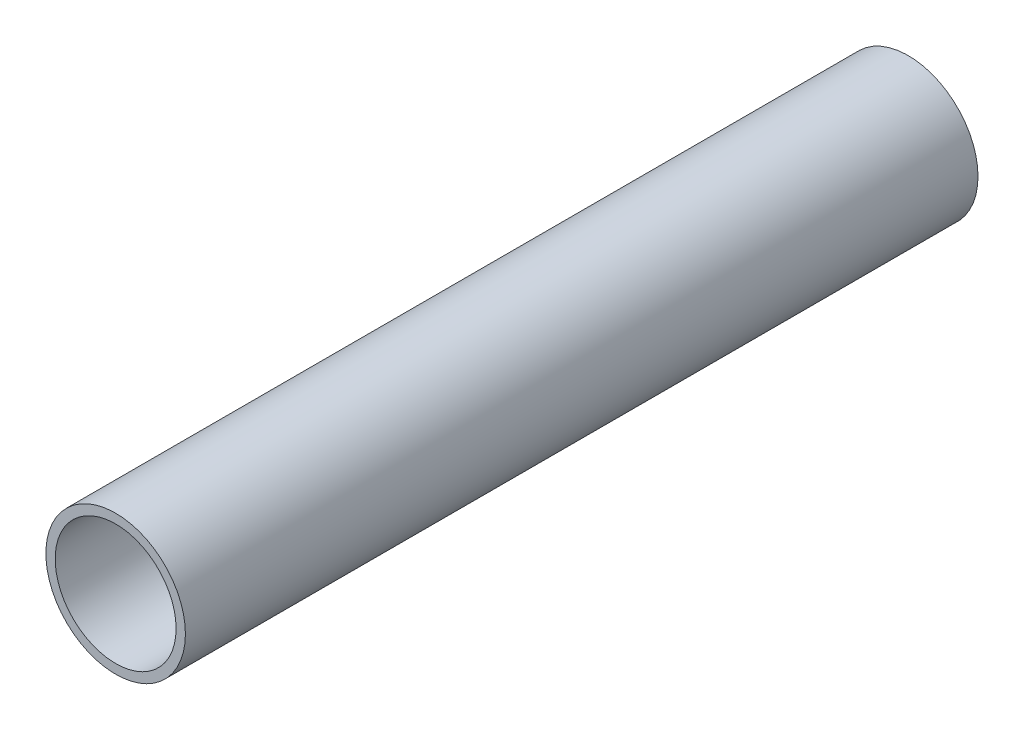
ISO-10303-21;
HEADER;
FILE_DESCRIPTION(('STEP AP214'),'2;1');
FILE_NAME('part.step','',(''),(''),'','','');
FILE_SCHEMA(('AUTOMOTIVE_DESIGN { 1 0 10303 214 1 1 1 1 }'));
ENDSEC;
DATA;
#1=APPLICATION_CONTEXT('core data for automotive mechanical design processes');
#2=APPLICATION_PROTOCOL_DEFINITION('international standard','automotive_design',2000,#1);
#3=PRODUCT_CONTEXT('',#1,'mechanical');
#4=PRODUCT('Part','Part','',(#3));
#5=PRODUCT_RELATED_PRODUCT_CATEGORY('part','',(#4));
#6=PRODUCT_DEFINITION_FORMATION('','',#4);
#7=PRODUCT_DEFINITION_CONTEXT('part definition',#1,'design');
#8=PRODUCT_DEFINITION('design','',#6,#7);
#9=PRODUCT_DEFINITION_SHAPE('','',#8);
#10=(LENGTH_UNIT() NAMED_UNIT(*) SI_UNIT(.MILLI.,.METRE.));
#11=(NAMED_UNIT(*) PLANE_ANGLE_UNIT() SI_UNIT($,.RADIAN.));
#12=(NAMED_UNIT(*) SI_UNIT($,.STERADIAN.) SOLID_ANGLE_UNIT());
#13=UNCERTAINTY_MEASURE_WITH_UNIT(LENGTH_MEASURE(1.E-05),#10,'distance_accuracy_value','');
#14=(GEOMETRIC_REPRESENTATION_CONTEXT(3) GLOBAL_UNCERTAINTY_ASSIGNED_CONTEXT((#13)) GLOBAL_UNIT_ASSIGNED_CONTEXT((#10,
#11,#12)) REPRESENTATION_CONTEXT('',''));
#15=CARTESIAN_POINT('',(0.,0.,0.));
#16=DIRECTION('',(0.,0.,1.));
#17=DIRECTION('',(1.,0.,0.));
#18=AXIS2_PLACEMENT_3D('',#15,#16,#17);
#19=CARTESIAN_POINT('',(0.,0.,108.204));
#20=DIRECTION('',(0.,0.,1.));
#21=DIRECTION('',(1.,0.,0.));
#22=AXIS2_PLACEMENT_3D('',#19,#20,#21);
#23=PLANE('',#22);
#24=CARTESIAN_POINT('',(0.,0.,108.204));
#25=DIRECTION('',(0.,0.,1.));
#26=DIRECTION('',(1.,0.,0.));
#27=AXIS2_PLACEMENT_3D('',#24,#25,#26);
#28=CIRCLE('',#27,9.525);
#29=CARTESIAN_POINT('',(9.525,0.,108.204));
#30=VERTEX_POINT('',#29);
#31=EDGE_CURVE('E10',#30,#30,#28,.T.);
#32=ORIENTED_EDGE('',*,*,#31,.T.);
#33=EDGE_LOOP('',(#32));
#34=FACE_BOUND('',#33,.T.);
#35=CARTESIAN_POINT('',(0.,0.,108.204));
#36=DIRECTION('',(0.,0.,1.));
#37=DIRECTION('',(1.,0.,0.));
#38=AXIS2_PLACEMENT_3D('',#35,#36,#37);
#39=CIRCLE('',#38,8.255);
#40=CARTESIAN_POINT('',(8.255,0.,108.204));
#41=VERTEX_POINT('',#40);
#42=EDGE_CURVE('E42',#41,#41,#39,.T.);
#43=ORIENTED_EDGE('',*,*,#42,.F.);
#44=EDGE_LOOP('',(#43));
#45=FACE_BOUND('',#44,.T.);
#46=ADVANCED_FACE('F31',(#34,#45),#23,.T.);
#47=CARTESIAN_POINT('',(0.,0.,0.));
#48=DIRECTION('',(0.,0.,1.));
#49=DIRECTION('',(1.,0.,0.));
#50=AXIS2_PLACEMENT_3D('',#47,#48,#49);
#51=PLANE('',#50);
#52=CARTESIAN_POINT('',(0.,0.,0.));
#53=DIRECTION('',(0.,0.,1.));
#54=DIRECTION('',(1.,0.,0.));
#55=AXIS2_PLACEMENT_3D('',#52,#53,#54);
#56=CIRCLE('',#55,9.525);
#57=CARTESIAN_POINT('',(9.525,0.,0.));
#58=VERTEX_POINT('',#57);
#59=EDGE_CURVE('E35',#58,#58,#56,.T.);
#60=ORIENTED_EDGE('',*,*,#59,.F.);
#61=EDGE_LOOP('',(#60));
#62=FACE_BOUND('',#61,.T.);
#63=CARTESIAN_POINT('',(0.,0.,0.));
#64=DIRECTION('',(0.,0.,1.));
#65=DIRECTION('',(1.,0.,0.));
#66=AXIS2_PLACEMENT_3D('',#63,#64,#65);
#67=CIRCLE('',#66,8.255);
#68=CARTESIAN_POINT('',(8.255,0.,0.));
#69=VERTEX_POINT('',#68);
#70=EDGE_CURVE('E44',#69,#69,#67,.T.);
#71=ORIENTED_EDGE('',*,*,#70,.T.);
#72=EDGE_LOOP('',(#71));
#73=FACE_BOUND('',#72,.T.);
#74=ADVANCED_FACE('F54',(#62,#73),#51,.F.);
#75=CARTESIAN_POINT('',(0.,0.,108.204));
#76=DIRECTION('',(0.,0.,-1.));
#77=DIRECTION('',(-1.,0.,0.));
#78=AXIS2_PLACEMENT_3D('',#75,#76,#77);
#79=CYLINDRICAL_SURFACE('',#78,9.525);
#80=ORIENTED_EDGE('',*,*,#31,.F.);
#81=EDGE_LOOP('',(#80));
#82=FACE_BOUND('',#81,.T.);
#83=ORIENTED_EDGE('',*,*,#59,.T.);
#84=EDGE_LOOP('',(#83));
#85=FACE_BOUND('',#84,.T.);
#86=ADVANCED_FACE('F33',(#82,#85),#79,.T.);
#87=CARTESIAN_POINT('',(0.,0.,108.204));
#88=DIRECTION('',(0.,0.,-1.));
#89=DIRECTION('',(-1.,0.,0.));
#90=AXIS2_PLACEMENT_3D('',#87,#88,#89);
#91=CYLINDRICAL_SURFACE('',#90,8.255);
#92=ORIENTED_EDGE('',*,*,#42,.T.);
#93=EDGE_LOOP('',(#92));
#94=FACE_BOUND('',#93,.T.);
#95=ORIENTED_EDGE('',*,*,#70,.F.);
#96=EDGE_LOOP('',(#95));
#97=FACE_BOUND('',#96,.T.);
#98=ADVANCED_FACE('F50',(#94,#97),#91,.F.);
#99=CLOSED_SHELL('',(#46,#74,#86,#98));
#100=MANIFOLD_SOLID_BREP('B2',#99);
#101=ADVANCED_BREP_SHAPE_REPRESENTATION('',(#18,#100),#14);
#102=SHAPE_DEFINITION_REPRESENTATION(#9,#101);
ENDSEC;
END-ISO-10303-21;
